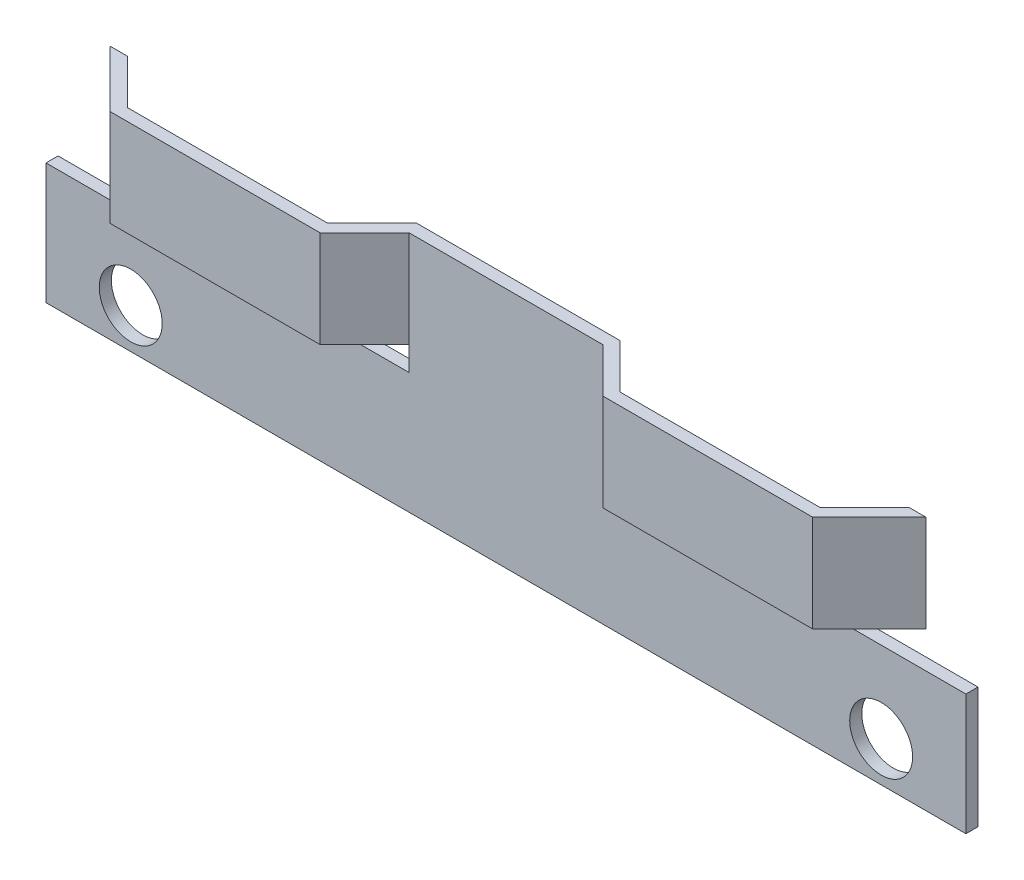
ISO-10303-21;
HEADER;
FILE_DESCRIPTION(('STEP AP214'),'2;1');
FILE_NAME('part.step','',(''),(''),'','','');
FILE_SCHEMA(('AUTOMOTIVE_DESIGN { 1 0 10303 214 1 1 1 1 }'));
ENDSEC;
DATA;
#1=APPLICATION_CONTEXT('core data for automotive mechanical design processes');
#2=APPLICATION_PROTOCOL_DEFINITION('international standard','automotive_design',2000,#1);
#3=PRODUCT_CONTEXT('',#1,'mechanical');
#4=PRODUCT('Part','Part','',(#3));
#5=PRODUCT_RELATED_PRODUCT_CATEGORY('part','',(#4));
#6=PRODUCT_DEFINITION_FORMATION('','',#4);
#7=PRODUCT_DEFINITION_CONTEXT('part definition',#1,'design');
#8=PRODUCT_DEFINITION('design','',#6,#7);
#9=PRODUCT_DEFINITION_SHAPE('','',#8);
#10=(LENGTH_UNIT() NAMED_UNIT(*) SI_UNIT(.MILLI.,.METRE.));
#11=(NAMED_UNIT(*) PLANE_ANGLE_UNIT() SI_UNIT($,.RADIAN.));
#12=(NAMED_UNIT(*) SI_UNIT($,.STERADIAN.) SOLID_ANGLE_UNIT());
#13=UNCERTAINTY_MEASURE_WITH_UNIT(LENGTH_MEASURE(1.E-05),#10,'distance_accuracy_value','');
#14=(GEOMETRIC_REPRESENTATION_CONTEXT(3) GLOBAL_UNCERTAINTY_ASSIGNED_CONTEXT((#13)) GLOBAL_UNIT_ASSIGNED_CONTEXT((#10,
#11,#12)) REPRESENTATION_CONTEXT('',''));
#15=CARTESIAN_POINT('',(0.,0.,0.));
#16=DIRECTION('',(0.,0.,1.));
#17=DIRECTION('',(1.,0.,0.));
#18=AXIS2_PLACEMENT_3D('',#15,#16,#17);
#19=CARTESIAN_POINT('',(-7.99999999999999,10.,-10.));
#20=DIRECTION('',(1.,0.,0.));
#21=DIRECTION('',(0.,0.,-1.));
#22=AXIS2_PLACEMENT_3D('',#19,#20,#21);
#23=PLANE('',#22);
#24=DIRECTION('',(0.,0.,-1.));
#25=VECTOR('',#24,1.);
#26=CARTESIAN_POINT('',(-7.99999999999999,2.,0.));
#27=LINE('',#26,#25);
#28=CARTESIAN_POINT('',(-7.99999999999999,2.,0.));
#29=VERTEX_POINT('',#28);
#30=CARTESIAN_POINT('',(-7.99999999999999,2.,-0.999999999999999));
#31=VERTEX_POINT('',#30);
#32=EDGE_CURVE('E229',#29,#31,#27,.T.);
#33=ORIENTED_EDGE('',*,*,#32,.T.);
#34=DIRECTION('',(0.,-1.,0.));
#35=VECTOR('',#34,1.);
#36=CARTESIAN_POINT('',(-7.99999999999999,0.,-1.));
#37=LINE('',#36,#35);
#38=CARTESIAN_POINT('',(-7.99999999999999,0.,-0.999999999999999));
#39=VERTEX_POINT('',#38);
#40=EDGE_CURVE('E354',#31,#39,#37,.T.);
#41=ORIENTED_EDGE('',*,*,#40,.T.);
#42=DIRECTION('',(0.,0.,1.));
#43=VECTOR('',#42,1.);
#44=CARTESIAN_POINT('',(-7.99999999999999,0.,-10.));
#45=LINE('',#44,#43);
#46=CARTESIAN_POINT('',(-7.99999999999999,0.,0.));
#47=VERTEX_POINT('',#46);
#48=EDGE_CURVE('E336',#39,#47,#45,.T.);
#49=ORIENTED_EDGE('',*,*,#48,.T.);
#50=DIRECTION('',(0.,1.,0.));
#51=VECTOR('',#50,1.);
#52=CARTESIAN_POINT('',(-7.99999999999999,10.,0.));
#53=LINE('',#52,#51);
#54=EDGE_CURVE('E331',#47,#29,#53,.T.);
#55=ORIENTED_EDGE('',*,*,#54,.T.);
#56=EDGE_LOOP('',(#33,#41,#49,#55));
#57=FACE_BOUND('',#56,.T.);
#58=ADVANCED_FACE('F37',(#57),#23,.F.);
#59=CARTESIAN_POINT('',(38.,-10.,-1.));
#60=DIRECTION('',(1.,0.,0.));
#61=DIRECTION('',(0.,0.,-1.));
#62=AXIS2_PLACEMENT_3D('',#59,#60,#61);
#63=PLANE('',#62);
#64=DIRECTION('',(0.,0.,1.));
#65=VECTOR('',#64,1.);
#66=CARTESIAN_POINT('',(38.,0.,-10.));
#67=LINE('',#66,#65);
#68=CARTESIAN_POINT('',(38.,0.,-0.999999999999999));
#69=VERTEX_POINT('',#68);
#70=CARTESIAN_POINT('',(38.,0.,0.));
#71=VERTEX_POINT('',#70);
#72=EDGE_CURVE('E332',#69,#71,#67,.T.);
#73=ORIENTED_EDGE('',*,*,#72,.T.);
#74=DIRECTION('',(0.,1.,0.));
#75=VECTOR('',#74,1.);
#76=CARTESIAN_POINT('',(38.,-10.,0.));
#77=LINE('',#76,#75);
#78=CARTESIAN_POINT('',(38.,-10.,0.));
#79=VERTEX_POINT('',#78);
#80=EDGE_CURVE('E368',#79,#71,#77,.T.);
#81=ORIENTED_EDGE('',*,*,#80,.F.);
#82=DIRECTION('',(0.,0.,1.));
#83=VECTOR('',#82,1.);
#84=CARTESIAN_POINT('',(38.,-10.,-1.));
#85=LINE('',#84,#83);
#86=CARTESIAN_POINT('',(38.,-10.,-1.));
#87=VERTEX_POINT('',#86);
#88=EDGE_CURVE('E11',#87,#79,#85,.T.);
#89=ORIENTED_EDGE('',*,*,#88,.F.);
#90=DIRECTION('',(0.,1.,0.));
#91=VECTOR('',#90,1.);
#92=CARTESIAN_POINT('',(38.,-10.,-1.));
#93=LINE('',#92,#91);
#94=EDGE_CURVE('E369',#87,#69,#93,.T.);
#95=ORIENTED_EDGE('',*,*,#94,.T.);
#96=EDGE_LOOP('',(#73,#81,#89,#95));
#97=FACE_BOUND('',#96,.T.);
#98=ADVANCED_FACE('F39',(#97),#63,.T.);
#99=CARTESIAN_POINT('',(-38.,-10.,-1.));
#100=DIRECTION('',(0.,-1.,0.));
#101=DIRECTION('',(0.,0.,-1.));
#102=AXIS2_PLACEMENT_3D('',#99,#100,#101);
#103=PLANE('',#102);
#104=DIRECTION('',(1.,0.,0.));
#105=VECTOR('',#104,1.);
#106=CARTESIAN_POINT('',(-38.,-10.,0.));
#107=LINE('',#106,#105);
#108=CARTESIAN_POINT('',(-38.,-10.,0.));
#109=VERTEX_POINT('',#108);
#110=EDGE_CURVE('E373',#109,#79,#107,.T.);
#111=ORIENTED_EDGE('',*,*,#110,.F.);
#112=DIRECTION('',(0.,0.,1.));
#113=VECTOR('',#112,1.);
#114=CARTESIAN_POINT('',(-38.,-10.,-1.));
#115=LINE('',#114,#113);
#116=CARTESIAN_POINT('',(-38.,-10.,-1.));
#117=VERTEX_POINT('',#116);
#118=EDGE_CURVE('E41',#117,#109,#115,.T.);
#119=ORIENTED_EDGE('',*,*,#118,.F.);
#120=DIRECTION('',(1.,0.,0.));
#121=VECTOR('',#120,1.);
#122=CARTESIAN_POINT('',(-38.,-10.,-1.));
#123=LINE('',#122,#121);
#124=EDGE_CURVE('E377',#117,#87,#123,.T.);
#125=ORIENTED_EDGE('',*,*,#124,.T.);
#126=ORIENTED_EDGE('',*,*,#88,.T.);
#127=EDGE_LOOP('',(#111,#119,#125,#126));
#128=FACE_BOUND('',#127,.T.);
#129=ADVANCED_FACE('F398',(#128),#103,.T.);
#130=CARTESIAN_POINT('',(-38.,-10.,-1.));
#131=DIRECTION('',(-1.,0.,0.));
#132=DIRECTION('',(0.,0.,1.));
#133=AXIS2_PLACEMENT_3D('',#130,#131,#132);
#134=PLANE('',#133);
#135=DIRECTION('',(0.,0.,1.));
#136=VECTOR('',#135,1.);
#137=CARTESIAN_POINT('',(-38.,0.,-10.));
#138=LINE('',#137,#136);
#139=CARTESIAN_POINT('',(-38.,0.,-0.999999999999999));
#140=VERTEX_POINT('',#139);
#141=CARTESIAN_POINT('',(-38.,0.,0.));
#142=VERTEX_POINT('',#141);
#143=EDGE_CURVE('E335',#140,#142,#138,.T.);
#144=ORIENTED_EDGE('',*,*,#143,.F.);
#145=DIRECTION('',(0.,-1.,0.));
#146=VECTOR('',#145,1.);
#147=CARTESIAN_POINT('',(-38.,-10.,-1.));
#148=LINE('',#147,#146);
#149=EDGE_CURVE('E375',#140,#117,#148,.T.);
#150=ORIENTED_EDGE('',*,*,#149,.T.);
#151=ORIENTED_EDGE('',*,*,#118,.T.);
#152=DIRECTION('',(0.,-1.,0.));
#153=VECTOR('',#152,1.);
#154=CARTESIAN_POINT('',(-38.,-10.,0.));
#155=LINE('',#154,#153);
#156=EDGE_CURVE('E385',#142,#109,#155,.T.);
#157=ORIENTED_EDGE('',*,*,#156,.F.);
#158=EDGE_LOOP('',(#144,#150,#151,#157));
#159=FACE_BOUND('',#158,.T.);
#160=ADVANCED_FACE('F582',(#159),#134,.T.);
#161=CARTESIAN_POINT('',(-38.,10.,-1.));
#162=DIRECTION('',(0.,1.,0.));
#163=DIRECTION('',(0.,0.,1.));
#164=AXIS2_PLACEMENT_3D('',#161,#162,#163);
#165=PLANE('',#164);
#166=DIRECTION('',(-1.,0.,0.));
#167=VECTOR('',#166,1.);
#168=CARTESIAN_POINT('',(-38.,10.,-1.));
#169=LINE('',#168,#167);
#170=CARTESIAN_POINT('',(8.41421356237308,10.,-0.999999999999999));
#171=VERTEX_POINT('',#170);
#172=CARTESIAN_POINT('',(-8.41421356237308,10.,-0.999999999999999));
#173=VERTEX_POINT('',#172);
#174=EDGE_CURVE('E372',#171,#173,#169,.T.);
#175=ORIENTED_EDGE('',*,*,#174,.T.);
#176=DIRECTION('',(-0.707106781186547,0.,0.707106781186548));
#177=VECTOR('',#176,1.);
#178=CARTESIAN_POINT('',(-8.41421356237308,10.,-0.999999999999999));
#179=LINE('',#178,#177);
#180=CARTESIAN_POINT('',(-12.0913256822069,10.,2.67711211983383));
#181=VERTEX_POINT('',#180);
#182=EDGE_CURVE('E219',#173,#181,#179,.T.);
#183=ORIENTED_EDGE('',*,*,#182,.T.);
#184=DIRECTION('',(-1.,0.,0.));
#185=VECTOR('',#184,1.);
#186=CARTESIAN_POINT('',(-12.0913256822069,10.,2.67711211983383));
#187=LINE('',#186,#185);
#188=CARTESIAN_POINT('',(-28.6064048197039,10.,2.67711211983383));
#189=VERTEX_POINT('',#188);
#190=EDGE_CURVE('E216',#181,#189,#187,.T.);
#191=ORIENTED_EDGE('',*,*,#190,.T.);
#192=DIRECTION('',(-0.707106781186547,0.,-0.707106781186548));
#193=VECTOR('',#192,1.);
#194=CARTESIAN_POINT('',(-28.6064048197039,10.,2.67711211983383));
#195=LINE('',#194,#193);
#196=CARTESIAN_POINT('',(-32.2835169395378,10.,-0.999999999999998));
#197=VERTEX_POINT('',#196);
#198=EDGE_CURVE('E239',#189,#197,#195,.T.);
#199=ORIENTED_EDGE('',*,*,#198,.T.);
#200=DIRECTION('',(-1.,0.,0.));
#201=VECTOR('',#200,1.);
#202=CARTESIAN_POINT('',(-32.2835169395378,10.,-0.999999999999998));
#203=LINE('',#202,#201);
#204=CARTESIAN_POINT('',(-33.6977305019109,10.,-0.999999999999999));
#205=VERTEX_POINT('',#204);
#206=EDGE_CURVE('E195',#197,#205,#203,.T.);
#207=ORIENTED_EDGE('',*,*,#206,.T.);
#208=DIRECTION('',(0.707106781186539,0.,0.707106781186556));
#209=VECTOR('',#208,1.);
#210=CARTESIAN_POINT('',(-29.0206183820772,10.,3.67711211983379));
#211=LINE('',#210,#209);
#212=CARTESIAN_POINT('',(-29.0206183820772,10.,3.67711211983379));
#213=VERTEX_POINT('',#212);
#214=EDGE_CURVE('E242',#205,#213,#211,.T.);
#215=ORIENTED_EDGE('',*,*,#214,.T.);
#216=DIRECTION('',(1.,0.,0.));
#217=VECTOR('',#216,1.);
#218=CARTESIAN_POINT('',(-11.6771121198339,10.,3.67711211983379));
#219=LINE('',#218,#217);
#220=CARTESIAN_POINT('',(-11.6771121198339,10.,3.67711211983379));
#221=VERTEX_POINT('',#220);
#222=EDGE_CURVE('E245',#213,#221,#219,.T.);
#223=ORIENTED_EDGE('',*,*,#222,.T.);
#224=DIRECTION('',(0.707106781186556,0.,-0.707106781186539));
#225=VECTOR('',#224,1.);
#226=CARTESIAN_POINT('',(-7.99999999999999,10.,0.));
#227=LINE('',#226,#225);
#228=CARTESIAN_POINT('',(-7.99999999999999,10.,0.));
#229=VERTEX_POINT('',#228);
#230=EDGE_CURVE('E248',#221,#229,#227,.T.);
#231=ORIENTED_EDGE('',*,*,#230,.T.);
#232=DIRECTION('',(-1.,0.,0.));
#233=VECTOR('',#232,1.);
#234=CARTESIAN_POINT('',(-38.,10.,0.));
#235=LINE('',#234,#233);
#236=CARTESIAN_POINT('',(7.99999999999999,10.,0.));
#237=VERTEX_POINT('',#236);
#238=EDGE_CURVE('E382',#237,#229,#235,.T.);
#239=ORIENTED_EDGE('',*,*,#238,.F.);
#240=DIRECTION('',(0.707106781186556,0.,0.707106781186539));
#241=VECTOR('',#240,1.);
#242=CARTESIAN_POINT('',(7.99999999999999,10.,0.));
#243=LINE('',#242,#241);
#244=CARTESIAN_POINT('',(11.6771121198339,10.,3.67711211983379));
#245=VERTEX_POINT('',#244);
#246=EDGE_CURVE('E253',#237,#245,#243,.T.);
#247=ORIENTED_EDGE('',*,*,#246,.T.);
#248=DIRECTION('',(1.,0.,0.));
#249=VECTOR('',#248,1.);
#250=CARTESIAN_POINT('',(11.6771121198339,10.,3.67711211983379));
#251=LINE('',#250,#249);
#252=CARTESIAN_POINT('',(29.0206183820772,10.,3.67711211983379));
#253=VERTEX_POINT('',#252);
#254=EDGE_CURVE('E296',#245,#253,#251,.T.);
#255=ORIENTED_EDGE('',*,*,#254,.T.);
#256=DIRECTION('',(0.707106781186539,0.,-0.707106781186556));
#257=VECTOR('',#256,1.);
#258=CARTESIAN_POINT('',(29.0206183820772,10.,3.67711211983379));
#259=LINE('',#258,#257);
#260=CARTESIAN_POINT('',(33.6977305019109,10.,-0.999999999999999));
#261=VERTEX_POINT('',#260);
#262=EDGE_CURVE('E299',#253,#261,#259,.T.);
#263=ORIENTED_EDGE('',*,*,#262,.T.);
#264=DIRECTION('',(-1.,0.,0.));
#265=VECTOR('',#264,1.);
#266=CARTESIAN_POINT('',(32.2835169395378,10.,-0.999999999999998));
#267=LINE('',#266,#265);
#268=CARTESIAN_POINT('',(32.2835169395378,10.,-0.999999999999998));
#269=VERTEX_POINT('',#268);
#270=EDGE_CURVE('E302',#261,#269,#267,.T.);
#271=ORIENTED_EDGE('',*,*,#270,.T.);
#272=DIRECTION('',(-0.707106781186547,0.,0.707106781186548));
#273=VECTOR('',#272,1.);
#274=CARTESIAN_POINT('',(28.6064048197039,10.,2.67711211983383));
#275=LINE('',#274,#273);
#276=CARTESIAN_POINT('',(28.6064048197039,10.,2.67711211983383));
#277=VERTEX_POINT('',#276);
#278=EDGE_CURVE('E305',#269,#277,#275,.T.);
#279=ORIENTED_EDGE('',*,*,#278,.T.);
#280=DIRECTION('',(-1.,0.,0.));
#281=VECTOR('',#280,1.);
#282=CARTESIAN_POINT('',(12.0913256822069,10.,2.67711211983383));
#283=LINE('',#282,#281);
#284=CARTESIAN_POINT('',(12.0913256822069,10.,2.67711211983383));
#285=VERTEX_POINT('',#284);
#286=EDGE_CURVE('E308',#277,#285,#283,.T.);
#287=ORIENTED_EDGE('',*,*,#286,.T.);
#288=DIRECTION('',(-0.707106781186547,0.,-0.707106781186548));
#289=VECTOR('',#288,1.);
#290=CARTESIAN_POINT('',(8.41421356237308,10.,-0.999999999999999));
#291=LINE('',#290,#289);
#292=EDGE_CURVE('E269',#285,#171,#291,.T.);
#293=ORIENTED_EDGE('',*,*,#292,.T.);
#294=EDGE_LOOP('',(#175,#183,#191,#199,#207,#215,#223,#231,#239,#247,#255,#263,#271,#279,#287,#293));
#295=FACE_BOUND('',#294,.T.);
#296=ADVANCED_FACE('F577',(#295),#165,.T.);
#297=CARTESIAN_POINT('',(0.,0.,-1.));
#298=DIRECTION('',(0.,0.,-1.));
#299=DIRECTION('',(-1.,0.,0.));
#300=AXIS2_PLACEMENT_3D('',#297,#298,#299);
#301=PLANE('',#300);
#302=ORIENTED_EDGE('',*,*,#40,.F.);
#303=DIRECTION('',(-1.,0.,0.));
#304=VECTOR('',#303,1.);
#305=CARTESIAN_POINT('',(-7.99999999999999,2.,-0.999999999999999));
#306=LINE('',#305,#304);
#307=CARTESIAN_POINT('',(-8.41421356237308,2.,-0.999999999999999));
#308=VERTEX_POINT('',#307);
#309=EDGE_CURVE('E232',#31,#308,#306,.T.);
#310=ORIENTED_EDGE('',*,*,#309,.T.);
#311=DIRECTION('',(0.,1.,0.));
#312=VECTOR('',#311,1.);
#313=CARTESIAN_POINT('',(-8.41421356237308,2.,-0.999999999999999));
#314=LINE('',#313,#312);
#315=EDGE_CURVE('E256',#308,#173,#314,.T.);
#316=ORIENTED_EDGE('',*,*,#315,.T.);
#317=ORIENTED_EDGE('',*,*,#174,.F.);
#318=DIRECTION('',(0.,1.,0.));
#319=VECTOR('',#318,1.);
#320=CARTESIAN_POINT('',(8.41421356237308,2.,-0.999999999999999));
#321=LINE('',#320,#319);
#322=CARTESIAN_POINT('',(8.41421356237308,2.,-0.999999999999999));
#323=VERTEX_POINT('',#322);
#324=EDGE_CURVE('E313',#323,#171,#321,.T.);
#325=ORIENTED_EDGE('',*,*,#324,.F.);
#326=DIRECTION('',(-1.,0.,0.));
#327=VECTOR('',#326,1.);
#328=CARTESIAN_POINT('',(7.99999999999999,2.,-0.999999999999999));
#329=LINE('',#328,#327);
#330=CARTESIAN_POINT('',(7.99999999999999,2.,-1.));
#331=VERTEX_POINT('',#330);
#332=EDGE_CURVE('E290',#323,#331,#329,.T.);
#333=ORIENTED_EDGE('',*,*,#332,.T.);
#334=DIRECTION('',(0.,1.,0.));
#335=VECTOR('',#334,1.);
#336=CARTESIAN_POINT('',(7.99999999999999,0.,-1.));
#337=LINE('',#336,#335);
#338=CARTESIAN_POINT('',(7.99999999999999,0.,-0.999999999999999));
#339=VERTEX_POINT('',#338);
#340=EDGE_CURVE('E57',#339,#331,#337,.T.);
#341=ORIENTED_EDGE('',*,*,#340,.F.);
#342=DIRECTION('',(-1.,0.,0.));
#343=VECTOR('',#342,1.);
#344=CARTESIAN_POINT('',(0.,0.,-1.));
#345=LINE('',#344,#343);
#346=EDGE_CURVE('E350',#69,#339,#345,.T.);
#347=ORIENTED_EDGE('',*,*,#346,.F.);
#348=ORIENTED_EDGE('',*,*,#94,.F.);
#349=ORIENTED_EDGE('',*,*,#124,.F.);
#350=ORIENTED_EDGE('',*,*,#149,.F.);
#351=DIRECTION('',(-1.,0.,0.));
#352=VECTOR('',#351,1.);
#353=CARTESIAN_POINT('',(0.,0.,-1.));
#354=LINE('',#353,#352);
#355=EDGE_CURVE('E352',#39,#140,#354,.T.);
#356=ORIENTED_EDGE('',*,*,#355,.F.);
#357=EDGE_LOOP('',(#302,#310,#316,#317,#325,#333,#341,#347,#348,#349,#350,#356));
#358=FACE_BOUND('',#357,.T.);
#359=CARTESIAN_POINT('',(-31.,-6.7,-0.999999999999999));
#360=DIRECTION('',(0.,0.,-1.));
#361=DIRECTION('',(-1.,0.,0.));
#362=AXIS2_PLACEMENT_3D('',#359,#360,#361);
#363=CIRCLE('',#362,2.6);
#364=CARTESIAN_POINT('',(-33.6,-6.7,-0.999999999999999));
#365=VERTEX_POINT('',#364);
#366=EDGE_CURVE('E365',#365,#365,#363,.T.);
#367=ORIENTED_EDGE('',*,*,#366,.F.);
#368=EDGE_LOOP('',(#367));
#369=FACE_BOUND('',#368,.T.);
#370=CARTESIAN_POINT('',(31.,-6.69999999999999,-0.999999999999999));
#371=DIRECTION('',(0.,0.,-1.));
#372=DIRECTION('',(-1.,0.,0.));
#373=AXIS2_PLACEMENT_3D('',#370,#371,#372);
#374=CIRCLE('',#373,2.6);
#375=CARTESIAN_POINT('',(28.4,-6.69999999999999,-0.999999999999999));
#376=VERTEX_POINT('',#375);
#377=EDGE_CURVE('E360',#376,#376,#374,.T.);
#378=ORIENTED_EDGE('',*,*,#377,.F.);
#379=EDGE_LOOP('',(#378));
#380=FACE_BOUND('',#379,.T.);
#381=ADVANCED_FACE('F407',(#358,#369,#380),#301,.T.);
#382=CARTESIAN_POINT('',(0.,0.,0.));
#383=DIRECTION('',(0.,0.,-1.));
#384=DIRECTION('',(-1.,0.,0.));
#385=AXIS2_PLACEMENT_3D('',#382,#383,#384);
#386=PLANE('',#385);
#387=CARTESIAN_POINT('',(-31.,-6.7,0.));
#388=DIRECTION('',(0.,0.,1.));
#389=DIRECTION('',(1.,0.,0.));
#390=AXIS2_PLACEMENT_3D('',#387,#388,#389);
#391=CIRCLE('',#390,2.6);
#392=CARTESIAN_POINT('',(-28.4,-6.7,0.));
#393=VERTEX_POINT('',#392);
#394=EDGE_CURVE('E357',#393,#393,#391,.T.);
#395=ORIENTED_EDGE('',*,*,#394,.F.);
#396=EDGE_LOOP('',(#395));
#397=FACE_BOUND('',#396,.T.);
#398=CARTESIAN_POINT('',(31.,-6.69999999999999,0.));
#399=DIRECTION('',(0.,0.,1.));
#400=DIRECTION('',(-1.,0.,0.));
#401=AXIS2_PLACEMENT_3D('',#398,#399,#400);
#402=CIRCLE('',#401,2.6);
#403=CARTESIAN_POINT('',(28.4,-6.69999999999999,0.));
#404=VERTEX_POINT('',#403);
#405=EDGE_CURVE('E356',#404,#404,#402,.T.);
#406=ORIENTED_EDGE('',*,*,#405,.F.);
#407=EDGE_LOOP('',(#406));
#408=FACE_BOUND('',#407,.T.);
#409=ORIENTED_EDGE('',*,*,#238,.T.);
#410=DIRECTION('',(0.,1.,0.));
#411=VECTOR('',#410,1.);
#412=CARTESIAN_POINT('',(-7.99999999999999,2.,0.));
#413=LINE('',#412,#411);
#414=EDGE_CURVE('E259',#29,#229,#413,.T.);
#415=ORIENTED_EDGE('',*,*,#414,.F.);
#416=ORIENTED_EDGE('',*,*,#54,.F.);
#417=DIRECTION('',(1.,0.,0.));
#418=VECTOR('',#417,1.);
#419=CARTESIAN_POINT('',(-38.,0.,0.));
#420=LINE('',#419,#418);
#421=EDGE_CURVE('E328',#142,#47,#420,.T.);
#422=ORIENTED_EDGE('',*,*,#421,.F.);
#423=ORIENTED_EDGE('',*,*,#156,.T.);
#424=ORIENTED_EDGE('',*,*,#110,.T.);
#425=ORIENTED_EDGE('',*,*,#80,.T.);
#426=DIRECTION('',(1.,0.,0.));
#427=VECTOR('',#426,1.);
#428=CARTESIAN_POINT('',(38.,0.,0.));
#429=LINE('',#428,#427);
#430=CARTESIAN_POINT('',(7.99999999999999,0.,0.));
#431=VERTEX_POINT('',#430);
#432=EDGE_CURVE('E342',#431,#71,#429,.T.);
#433=ORIENTED_EDGE('',*,*,#432,.F.);
#434=DIRECTION('',(0.,-1.,0.));
#435=VECTOR('',#434,1.);
#436=CARTESIAN_POINT('',(7.99999999999999,10.,0.));
#437=LINE('',#436,#435);
#438=CARTESIAN_POINT('',(7.99999999999999,2.,0.));
#439=VERTEX_POINT('',#438);
#440=EDGE_CURVE('E316',#439,#431,#437,.T.);
#441=ORIENTED_EDGE('',*,*,#440,.F.);
#442=EDGE_CURVE('E339',#237,#439,#437,.T.);
#443=ORIENTED_EDGE('',*,*,#442,.F.);
#444=EDGE_LOOP('',(#409,#415,#416,#422,#423,#424,#425,#433,#441,#443));
#445=FACE_BOUND('',#444,.T.);
#446=ADVANCED_FACE('F390',(#397,#408,#445),#386,.F.);
#447=CARTESIAN_POINT('',(31.,-6.69999999999999,-10.));
#448=DIRECTION('',(0.,0.,1.));
#449=DIRECTION('',(1.,0.,0.));
#450=AXIS2_PLACEMENT_3D('',#447,#448,#449);
#451=CYLINDRICAL_SURFACE('',#450,2.6);
#452=ORIENTED_EDGE('',*,*,#377,.T.);
#453=EDGE_LOOP('',(#452));
#454=FACE_BOUND('',#453,.T.);
#455=ORIENTED_EDGE('',*,*,#405,.T.);
#456=EDGE_LOOP('',(#455));
#457=FACE_BOUND('',#456,.T.);
#458=ADVANCED_FACE('F601',(#454,#457),#451,.F.);
#459=CARTESIAN_POINT('',(-31.,-6.7,-10.));
#460=DIRECTION('',(0.,0.,1.));
#461=DIRECTION('',(1.,0.,0.));
#462=AXIS2_PLACEMENT_3D('',#459,#460,#461);
#463=CYLINDRICAL_SURFACE('',#462,2.6);
#464=ORIENTED_EDGE('',*,*,#366,.T.);
#465=EDGE_LOOP('',(#464));
#466=FACE_BOUND('',#465,.T.);
#467=ORIENTED_EDGE('',*,*,#394,.T.);
#468=EDGE_LOOP('',(#467));
#469=FACE_BOUND('',#468,.T.);
#470=ADVANCED_FACE('F434',(#466,#469),#463,.F.);
#471=CARTESIAN_POINT('',(38.,0.,-10.));
#472=DIRECTION('',(0.,-1.,0.));
#473=DIRECTION('',(0.,0.,-1.));
#474=AXIS2_PLACEMENT_3D('',#471,#472,#473);
#475=PLANE('',#474);
#476=ORIENTED_EDGE('',*,*,#346,.T.);
#477=DIRECTION('',(0.,0.,1.));
#478=VECTOR('',#477,1.);
#479=CARTESIAN_POINT('',(7.99999999999999,0.,-10.));
#480=LINE('',#479,#478);
#481=EDGE_CURVE('E344',#339,#431,#480,.T.);
#482=ORIENTED_EDGE('',*,*,#481,.T.);
#483=ORIENTED_EDGE('',*,*,#432,.T.);
#484=ORIENTED_EDGE('',*,*,#72,.F.);
#485=EDGE_LOOP('',(#476,#482,#483,#484));
#486=FACE_BOUND('',#485,.T.);
#487=ADVANCED_FACE('F404',(#486),#475,.F.);
#488=CARTESIAN_POINT('',(7.99999999999999,10.,-10.));
#489=DIRECTION('',(-1.,0.,0.));
#490=DIRECTION('',(0.,0.,1.));
#491=AXIS2_PLACEMENT_3D('',#488,#489,#490);
#492=PLANE('',#491);
#493=ORIENTED_EDGE('',*,*,#340,.T.);
#494=DIRECTION('',(0.,0.,1.));
#495=VECTOR('',#494,1.);
#496=CARTESIAN_POINT('',(7.99999999999999,2.,0.));
#497=LINE('',#496,#495);
#498=EDGE_CURVE('E52',#331,#439,#497,.T.);
#499=ORIENTED_EDGE('',*,*,#498,.T.);
#500=ORIENTED_EDGE('',*,*,#440,.T.);
#501=ORIENTED_EDGE('',*,*,#481,.F.);
#502=EDGE_LOOP('',(#493,#499,#500,#501));
#503=FACE_BOUND('',#502,.T.);
#504=ADVANCED_FACE('F423',(#503),#492,.F.);
#505=CARTESIAN_POINT('',(-38.,0.,-10.));
#506=DIRECTION('',(0.,-1.,0.));
#507=DIRECTION('',(0.,0.,-1.));
#508=AXIS2_PLACEMENT_3D('',#505,#506,#507);
#509=PLANE('',#508);
#510=ORIENTED_EDGE('',*,*,#355,.T.);
#511=ORIENTED_EDGE('',*,*,#143,.T.);
#512=ORIENTED_EDGE('',*,*,#421,.T.);
#513=ORIENTED_EDGE('',*,*,#48,.F.);
#514=EDGE_LOOP('',(#510,#511,#512,#513));
#515=FACE_BOUND('',#514,.T.);
#516=ADVANCED_FACE('F425',(#515),#509,.F.);
#517=CARTESIAN_POINT('',(8.41421356237308,2.,-0.999999999999999));
#518=DIRECTION('',(0.707106781186548,0.,-0.707106781186547));
#519=DIRECTION('',(-0.707106781186547,0.,-0.707106781186548));
#520=AXIS2_PLACEMENT_3D('',#517,#518,#519);
#521=PLANE('',#520);
#522=ORIENTED_EDGE('',*,*,#292,.F.);
#523=DIRECTION('',(0.,1.,0.));
#524=VECTOR('',#523,1.);
#525=CARTESIAN_POINT('',(12.0913256822069,2.,2.67711211983383));
#526=LINE('',#525,#524);
#527=CARTESIAN_POINT('',(12.0913256822069,2.,2.67711211983383));
#528=VERTEX_POINT('',#527);
#529=EDGE_CURVE('E317',#528,#285,#526,.T.);
#530=ORIENTED_EDGE('',*,*,#529,.F.);
#531=DIRECTION('',(-0.707106781186547,0.,-0.707106781186548));
#532=VECTOR('',#531,1.);
#533=CARTESIAN_POINT('',(8.41421356237308,2.,-0.999999999999999));
#534=LINE('',#533,#532);
#535=EDGE_CURVE('E287',#528,#323,#534,.T.);
#536=ORIENTED_EDGE('',*,*,#535,.T.);
#537=ORIENTED_EDGE('',*,*,#324,.T.);
#538=EDGE_LOOP('',(#522,#530,#536,#537));
#539=FACE_BOUND('',#538,.T.);
#540=ADVANCED_FACE('F431',(#539),#521,.T.);
#541=CARTESIAN_POINT('',(12.0913256822069,2.,2.67711211983383));
#542=DIRECTION('',(0.,0.,-1.));
#543=DIRECTION('',(-1.,0.,0.));
#544=AXIS2_PLACEMENT_3D('',#541,#542,#543);
#545=PLANE('',#544);
#546=ORIENTED_EDGE('',*,*,#286,.F.);
#547=DIRECTION('',(0.,1.,0.));
#548=VECTOR('',#547,1.);
#549=CARTESIAN_POINT('',(28.6064048197039,2.,2.67711211983383));
#550=LINE('',#549,#548);
#551=CARTESIAN_POINT('',(28.6064048197039,2.,2.67711211983383));
#552=VERTEX_POINT('',#551);
#553=EDGE_CURVE('E319',#552,#277,#550,.T.);
#554=ORIENTED_EDGE('',*,*,#553,.F.);
#555=DIRECTION('',(-1.,0.,0.));
#556=VECTOR('',#555,1.);
#557=CARTESIAN_POINT('',(12.0913256822069,2.,2.67711211983383));
#558=LINE('',#557,#556);
#559=EDGE_CURVE('E284',#552,#528,#558,.T.);
#560=ORIENTED_EDGE('',*,*,#559,.T.);
#561=ORIENTED_EDGE('',*,*,#529,.T.);
#562=EDGE_LOOP('',(#546,#554,#560,#561));
#563=FACE_BOUND('',#562,.T.);
#564=ADVANCED_FACE('F461',(#563),#545,.T.);
#565=CARTESIAN_POINT('',(28.6064048197039,2.,2.67711211983383));
#566=DIRECTION('',(-0.707106781186548,0.,-0.707106781186547));
#567=DIRECTION('',(-0.707106781186547,0.,0.707106781186548));
#568=AXIS2_PLACEMENT_3D('',#565,#566,#567);
#569=PLANE('',#568);
#570=ORIENTED_EDGE('',*,*,#278,.F.);
#571=DIRECTION('',(0.,1.,0.));
#572=VECTOR('',#571,1.);
#573=CARTESIAN_POINT('',(32.2835169395378,2.,-0.999999999999998));
#574=LINE('',#573,#572);
#575=CARTESIAN_POINT('',(32.2835169395378,2.,-0.999999999999998));
#576=VERTEX_POINT('',#575);
#577=EDGE_CURVE('E321',#576,#269,#574,.T.);
#578=ORIENTED_EDGE('',*,*,#577,.F.);
#579=DIRECTION('',(-0.707106781186547,0.,0.707106781186548));
#580=VECTOR('',#579,1.);
#581=CARTESIAN_POINT('',(28.6064048197039,2.,2.67711211983383));
#582=LINE('',#581,#580);
#583=EDGE_CURVE('E281',#576,#552,#582,.T.);
#584=ORIENTED_EDGE('',*,*,#583,.T.);
#585=ORIENTED_EDGE('',*,*,#553,.T.);
#586=EDGE_LOOP('',(#570,#578,#584,#585));
#587=FACE_BOUND('',#586,.T.);
#588=ADVANCED_FACE('F457',(#587),#569,.T.);
#589=CARTESIAN_POINT('',(32.2835169395378,2.,-0.999999999999998));
#590=DIRECTION('',(0.,0.,-1.));
#591=DIRECTION('',(-1.,0.,0.));
#592=AXIS2_PLACEMENT_3D('',#589,#590,#591);
#593=PLANE('',#592);
#594=ORIENTED_EDGE('',*,*,#270,.F.);
#595=DIRECTION('',(0.,1.,0.));
#596=VECTOR('',#595,1.);
#597=CARTESIAN_POINT('',(33.6977305019109,2.,-0.999999999999999));
#598=LINE('',#597,#596);
#599=CARTESIAN_POINT('',(33.6977305019109,2.,-0.999999999999999));
#600=VERTEX_POINT('',#599);
#601=EDGE_CURVE('E323',#600,#261,#598,.T.);
#602=ORIENTED_EDGE('',*,*,#601,.F.);
#603=DIRECTION('',(-1.,0.,0.));
#604=VECTOR('',#603,1.);
#605=CARTESIAN_POINT('',(32.2835169395378,2.,-0.999999999999998));
#606=LINE('',#605,#604);
#607=EDGE_CURVE('E278',#600,#576,#606,.T.);
#608=ORIENTED_EDGE('',*,*,#607,.T.);
#609=ORIENTED_EDGE('',*,*,#577,.T.);
#610=EDGE_LOOP('',(#594,#602,#608,#609));
#611=FACE_BOUND('',#610,.T.);
#612=ADVANCED_FACE('F453',(#611),#593,.T.);
#613=CARTESIAN_POINT('',(29.0206183820772,2.,3.67711211983379));
#614=DIRECTION('',(0.707106781186556,0.,0.707106781186539));
#615=DIRECTION('',(0.707106781186539,0.,-0.707106781186556));
#616=AXIS2_PLACEMENT_3D('',#613,#614,#615);
#617=PLANE('',#616);
#618=ORIENTED_EDGE('',*,*,#262,.F.);
#619=DIRECTION('',(0.,1.,0.));
#620=VECTOR('',#619,1.);
#621=CARTESIAN_POINT('',(29.0206183820772,2.,3.67711211983379));
#622=LINE('',#621,#620);
#623=CARTESIAN_POINT('',(29.0206183820772,2.,3.67711211983379));
#624=VERTEX_POINT('',#623);
#625=EDGE_CURVE('E325',#624,#253,#622,.T.);
#626=ORIENTED_EDGE('',*,*,#625,.F.);
#627=DIRECTION('',(0.707106781186539,0.,-0.707106781186556));
#628=VECTOR('',#627,1.);
#629=CARTESIAN_POINT('',(29.0206183820772,2.,3.67711211983379));
#630=LINE('',#629,#628);
#631=EDGE_CURVE('E275',#624,#600,#630,.T.);
#632=ORIENTED_EDGE('',*,*,#631,.T.);
#633=ORIENTED_EDGE('',*,*,#601,.T.);
#634=EDGE_LOOP('',(#618,#626,#632,#633));
#635=FACE_BOUND('',#634,.T.);
#636=ADVANCED_FACE('F449',(#635),#617,.T.);
#637=CARTESIAN_POINT('',(11.6771121198339,2.,3.67711211983379));
#638=DIRECTION('',(0.,0.,1.));
#639=DIRECTION('',(1.,0.,0.));
#640=AXIS2_PLACEMENT_3D('',#637,#638,#639);
#641=PLANE('',#640);
#642=ORIENTED_EDGE('',*,*,#254,.F.);
#643=DIRECTION('',(0.,1.,0.));
#644=VECTOR('',#643,1.);
#645=CARTESIAN_POINT('',(11.6771121198339,2.,3.67711211983379));
#646=LINE('',#645,#644);
#647=CARTESIAN_POINT('',(11.6771121198339,2.,3.67711211983379));
#648=VERTEX_POINT('',#647);
#649=EDGE_CURVE('E293',#648,#245,#646,.T.);
#650=ORIENTED_EDGE('',*,*,#649,.F.);
#651=DIRECTION('',(1.,0.,0.));
#652=VECTOR('',#651,1.);
#653=CARTESIAN_POINT('',(11.6771121198339,2.,3.67711211983379));
#654=LINE('',#653,#652);
#655=EDGE_CURVE('E272',#648,#624,#654,.T.);
#656=ORIENTED_EDGE('',*,*,#655,.T.);
#657=ORIENTED_EDGE('',*,*,#625,.T.);
#658=EDGE_LOOP('',(#642,#650,#656,#657));
#659=FACE_BOUND('',#658,.T.);
#660=ADVANCED_FACE('F446',(#659),#641,.T.);
#661=CARTESIAN_POINT('',(7.99999999999999,2.,0.));
#662=DIRECTION('',(-0.707106781186539,0.,0.707106781186556));
#663=DIRECTION('',(0.707106781186556,0.,0.707106781186539));
#664=AXIS2_PLACEMENT_3D('',#661,#662,#663);
#665=PLANE('',#664);
#666=ORIENTED_EDGE('',*,*,#246,.F.);
#667=ORIENTED_EDGE('',*,*,#442,.T.);
#668=DIRECTION('',(0.707106781186556,0.,0.707106781186539));
#669=VECTOR('',#668,1.);
#670=CARTESIAN_POINT('',(7.99999999999999,2.,0.));
#671=LINE('',#670,#669);
#672=EDGE_CURVE('E268',#439,#648,#671,.T.);
#673=ORIENTED_EDGE('',*,*,#672,.T.);
#674=ORIENTED_EDGE('',*,*,#649,.T.);
#675=EDGE_LOOP('',(#666,#667,#673,#674));
#676=FACE_BOUND('',#675,.T.);
#677=ADVANCED_FACE('F419',(#676),#665,.T.);
#678=CARTESIAN_POINT('',(0.,2.,0.));
#679=DIRECTION('',(0.,-1.,0.));
#680=DIRECTION('',(0.,0.,-1.));
#681=AXIS2_PLACEMENT_3D('',#678,#679,#680);
#682=PLANE('',#681);
#683=ORIENTED_EDGE('',*,*,#498,.F.);
#684=ORIENTED_EDGE('',*,*,#332,.F.);
#685=ORIENTED_EDGE('',*,*,#535,.F.);
#686=ORIENTED_EDGE('',*,*,#559,.F.);
#687=ORIENTED_EDGE('',*,*,#583,.F.);
#688=ORIENTED_EDGE('',*,*,#607,.F.);
#689=ORIENTED_EDGE('',*,*,#631,.F.);
#690=ORIENTED_EDGE('',*,*,#655,.F.);
#691=ORIENTED_EDGE('',*,*,#672,.F.);
#692=EDGE_LOOP('',(#683,#684,#685,#686,#687,#688,#689,#690,#691));
#693=FACE_BOUND('',#692,.T.);
#694=ADVANCED_FACE('F412',(#693),#682,.T.);
#695=CARTESIAN_POINT('',(-28.6064048197039,2.,2.67711211983383));
#696=DIRECTION('',(0.707106781186548,0.,-0.707106781186547));
#697=DIRECTION('',(-0.707106781186547,0.,-0.707106781186548));
#698=AXIS2_PLACEMENT_3D('',#695,#696,#697);
#699=PLANE('',#698);
#700=ORIENTED_EDGE('',*,*,#198,.F.);
#701=DIRECTION('',(0.,1.,0.));
#702=VECTOR('',#701,1.);
#703=CARTESIAN_POINT('',(-28.6064048197039,2.,2.67711211983383));
#704=LINE('',#703,#702);
#705=CARTESIAN_POINT('',(-28.6064048197039,2.,2.67711211983383));
#706=VERTEX_POINT('',#705);
#707=EDGE_CURVE('E215',#706,#189,#704,.T.);
#708=ORIENTED_EDGE('',*,*,#707,.F.);
#709=DIRECTION('',(-0.707106781186547,0.,-0.707106781186548));
#710=VECTOR('',#709,1.);
#711=CARTESIAN_POINT('',(-28.6064048197039,2.,2.67711211983383));
#712=LINE('',#711,#710);
#713=CARTESIAN_POINT('',(-32.2835169395378,2.,-0.999999999999998));
#714=VERTEX_POINT('',#713);
#715=EDGE_CURVE('E208',#706,#714,#712,.T.);
#716=ORIENTED_EDGE('',*,*,#715,.T.);
#717=DIRECTION('',(0.,1.,0.));
#718=VECTOR('',#717,1.);
#719=CARTESIAN_POINT('',(-32.2835169395378,2.,-0.999999999999998));
#720=LINE('',#719,#718);
#721=EDGE_CURVE('E190',#714,#197,#720,.T.);
#722=ORIENTED_EDGE('',*,*,#721,.T.);
#723=EDGE_LOOP('',(#700,#708,#716,#722));
#724=FACE_BOUND('',#723,.T.);
#725=ADVANCED_FACE('F214',(#724),#699,.T.);
#726=CARTESIAN_POINT('',(-12.0913256822069,2.,2.67711211983383));
#727=DIRECTION('',(0.,0.,-1.));
#728=DIRECTION('',(-1.,0.,0.));
#729=AXIS2_PLACEMENT_3D('',#726,#727,#728);
#730=PLANE('',#729);
#731=ORIENTED_EDGE('',*,*,#190,.F.);
#732=DIRECTION('',(0.,1.,0.));
#733=VECTOR('',#732,1.);
#734=CARTESIAN_POINT('',(-12.0913256822069,2.,2.67711211983383));
#735=LINE('',#734,#733);
#736=CARTESIAN_POINT('',(-12.0913256822069,2.,2.67711211983383));
#737=VERTEX_POINT('',#736);
#738=EDGE_CURVE('E254',#737,#181,#735,.T.);
#739=ORIENTED_EDGE('',*,*,#738,.F.);
#740=DIRECTION('',(-1.,0.,0.));
#741=VECTOR('',#740,1.);
#742=CARTESIAN_POINT('',(-12.0913256822069,2.,2.67711211983383));
#743=LINE('',#742,#741);
#744=EDGE_CURVE('E201',#737,#706,#743,.T.);
#745=ORIENTED_EDGE('',*,*,#744,.T.);
#746=ORIENTED_EDGE('',*,*,#707,.T.);
#747=EDGE_LOOP('',(#731,#739,#745,#746));
#748=FACE_BOUND('',#747,.T.);
#749=ADVANCED_FACE('F473',(#748),#730,.T.);
#750=CARTESIAN_POINT('',(-8.41421356237308,2.,-0.999999999999999));
#751=DIRECTION('',(-0.707106781186548,0.,-0.707106781186547));
#752=DIRECTION('',(-0.707106781186547,0.,0.707106781186548));
#753=AXIS2_PLACEMENT_3D('',#750,#751,#752);
#754=PLANE('',#753);
#755=ORIENTED_EDGE('',*,*,#182,.F.);
#756=ORIENTED_EDGE('',*,*,#315,.F.);
#757=DIRECTION('',(-0.707106781186547,0.,0.707106781186548));
#758=VECTOR('',#757,1.);
#759=CARTESIAN_POINT('',(-8.41421356237308,2.,-0.999999999999999));
#760=LINE('',#759,#758);
#761=EDGE_CURVE('E235',#308,#737,#760,.T.);
#762=ORIENTED_EDGE('',*,*,#761,.T.);
#763=ORIENTED_EDGE('',*,*,#738,.T.);
#764=EDGE_LOOP('',(#755,#756,#762,#763));
#765=FACE_BOUND('',#764,.T.);
#766=ADVANCED_FACE('F487',(#765),#754,.T.);
#767=CARTESIAN_POINT('',(-7.99999999999999,2.,0.));
#768=DIRECTION('',(0.707106781186539,0.,0.707106781186556));
#769=DIRECTION('',(0.707106781186556,0.,-0.707106781186539));
#770=AXIS2_PLACEMENT_3D('',#767,#768,#769);
#771=PLANE('',#770);
#772=ORIENTED_EDGE('',*,*,#230,.F.);
#773=DIRECTION('',(0.,1.,0.));
#774=VECTOR('',#773,1.);
#775=CARTESIAN_POINT('',(-11.6771121198339,2.,3.67711211983379));
#776=LINE('',#775,#774);
#777=CARTESIAN_POINT('',(-11.6771121198339,2.,3.67711211983379));
#778=VERTEX_POINT('',#777);
#779=EDGE_CURVE('E262',#778,#221,#776,.T.);
#780=ORIENTED_EDGE('',*,*,#779,.F.);
#781=DIRECTION('',(0.707106781186556,0.,-0.707106781186539));
#782=VECTOR('',#781,1.);
#783=CARTESIAN_POINT('',(-7.99999999999999,2.,0.));
#784=LINE('',#783,#782);
#785=EDGE_CURVE('E226',#778,#29,#784,.T.);
#786=ORIENTED_EDGE('',*,*,#785,.T.);
#787=ORIENTED_EDGE('',*,*,#414,.T.);
#788=EDGE_LOOP('',(#772,#780,#786,#787));
#789=FACE_BOUND('',#788,.T.);
#790=ADVANCED_FACE('F483',(#789),#771,.T.);
#791=CARTESIAN_POINT('',(-11.6771121198339,2.,3.67711211983379));
#792=DIRECTION('',(0.,0.,1.));
#793=DIRECTION('',(1.,0.,0.));
#794=AXIS2_PLACEMENT_3D('',#791,#792,#793);
#795=PLANE('',#794);
#796=ORIENTED_EDGE('',*,*,#222,.F.);
#797=DIRECTION('',(0.,1.,0.));
#798=VECTOR('',#797,1.);
#799=CARTESIAN_POINT('',(-29.0206183820772,2.,3.67711211983379));
#800=LINE('',#799,#798);
#801=CARTESIAN_POINT('',(-29.0206183820772,2.,3.67711211983379));
#802=VERTEX_POINT('',#801);
#803=EDGE_CURVE('E264',#802,#213,#800,.T.);
#804=ORIENTED_EDGE('',*,*,#803,.F.);
#805=DIRECTION('',(1.,0.,0.));
#806=VECTOR('',#805,1.);
#807=CARTESIAN_POINT('',(-11.6771121198339,2.,3.67711211983379));
#808=LINE('',#807,#806);
#809=EDGE_CURVE('E223',#802,#778,#808,.T.);
#810=ORIENTED_EDGE('',*,*,#809,.T.);
#811=ORIENTED_EDGE('',*,*,#779,.T.);
#812=EDGE_LOOP('',(#796,#804,#810,#811));
#813=FACE_BOUND('',#812,.T.);
#814=ADVANCED_FACE('F479',(#813),#795,.T.);
#815=CARTESIAN_POINT('',(-29.0206183820772,2.,3.67711211983379));
#816=DIRECTION('',(-0.707106781186556,0.,0.707106781186539));
#817=DIRECTION('',(0.707106781186539,0.,0.707106781186556));
#818=AXIS2_PLACEMENT_3D('',#815,#816,#817);
#819=PLANE('',#818);
#820=ORIENTED_EDGE('',*,*,#214,.F.);
#821=DIRECTION('',(0.,1.,0.));
#822=VECTOR('',#821,1.);
#823=CARTESIAN_POINT('',(-33.6977305019109,2.,-0.999999999999999));
#824=LINE('',#823,#822);
#825=CARTESIAN_POINT('',(-33.6977305019109,2.,-0.999999999999999));
#826=VERTEX_POINT('',#825);
#827=EDGE_CURVE('E200',#826,#205,#824,.T.);
#828=ORIENTED_EDGE('',*,*,#827,.F.);
#829=DIRECTION('',(0.707106781186539,0.,0.707106781186556));
#830=VECTOR('',#829,1.);
#831=CARTESIAN_POINT('',(-29.0206183820772,2.,3.67711211983379));
#832=LINE('',#831,#830);
#833=EDGE_CURVE('E212',#826,#802,#832,.T.);
#834=ORIENTED_EDGE('',*,*,#833,.T.);
#835=ORIENTED_EDGE('',*,*,#803,.T.);
#836=EDGE_LOOP('',(#820,#828,#834,#835));
#837=FACE_BOUND('',#836,.T.);
#838=ADVANCED_FACE('F476',(#837),#819,.T.);
#839=CARTESIAN_POINT('',(-32.2835169395378,2.,-0.999999999999998));
#840=DIRECTION('',(0.,0.,-1.));
#841=DIRECTION('',(-1.,0.,0.));
#842=AXIS2_PLACEMENT_3D('',#839,#840,#841);
#843=PLANE('',#842);
#844=ORIENTED_EDGE('',*,*,#206,.F.);
#845=ORIENTED_EDGE('',*,*,#721,.F.);
#846=DIRECTION('',(-1.,0.,0.));
#847=VECTOR('',#846,1.);
#848=CARTESIAN_POINT('',(-32.2835169395378,2.,-0.999999999999998));
#849=LINE('',#848,#847);
#850=EDGE_CURVE('E193',#714,#826,#849,.T.);
#851=ORIENTED_EDGE('',*,*,#850,.T.);
#852=ORIENTED_EDGE('',*,*,#827,.T.);
#853=EDGE_LOOP('',(#844,#845,#851,#852));
#854=FACE_BOUND('',#853,.T.);
#855=ADVANCED_FACE('F192',(#854),#843,.T.);
#856=CARTESIAN_POINT('',(0.,2.,0.));
#857=DIRECTION('',(0.,1.,0.));
#858=DIRECTION('',(0.,0.,1.));
#859=AXIS2_PLACEMENT_3D('',#856,#857,#858);
#860=PLANE('',#859);
#861=ORIENTED_EDGE('',*,*,#715,.F.);
#862=ORIENTED_EDGE('',*,*,#744,.F.);
#863=ORIENTED_EDGE('',*,*,#761,.F.);
#864=ORIENTED_EDGE('',*,*,#309,.F.);
#865=ORIENTED_EDGE('',*,*,#32,.F.);
#866=ORIENTED_EDGE('',*,*,#785,.F.);
#867=ORIENTED_EDGE('',*,*,#809,.F.);
#868=ORIENTED_EDGE('',*,*,#833,.F.);
#869=ORIENTED_EDGE('',*,*,#850,.F.);
#870=EDGE_LOOP('',(#861,#862,#863,#864,#865,#866,#867,#868,#869));
#871=FACE_BOUND('',#870,.T.);
#872=ADVANCED_FACE('F206',(#871),#860,.F.);
#873=CLOSED_SHELL('',(#58,#98,#129,#160,#296,#381,#446,#458,#470,#487,#504,#516,#540,#564,#588,
#612,#636,#660,#677,#694,#725,#749,#766,#790,#814,#838,#855,#872));
#874=MANIFOLD_SOLID_BREP('B2',#873);
#875=ADVANCED_BREP_SHAPE_REPRESENTATION('',(#18,#874),#14);
#876=SHAPE_DEFINITION_REPRESENTATION(#9,#875);
ENDSEC;
END-ISO-10303-21;
